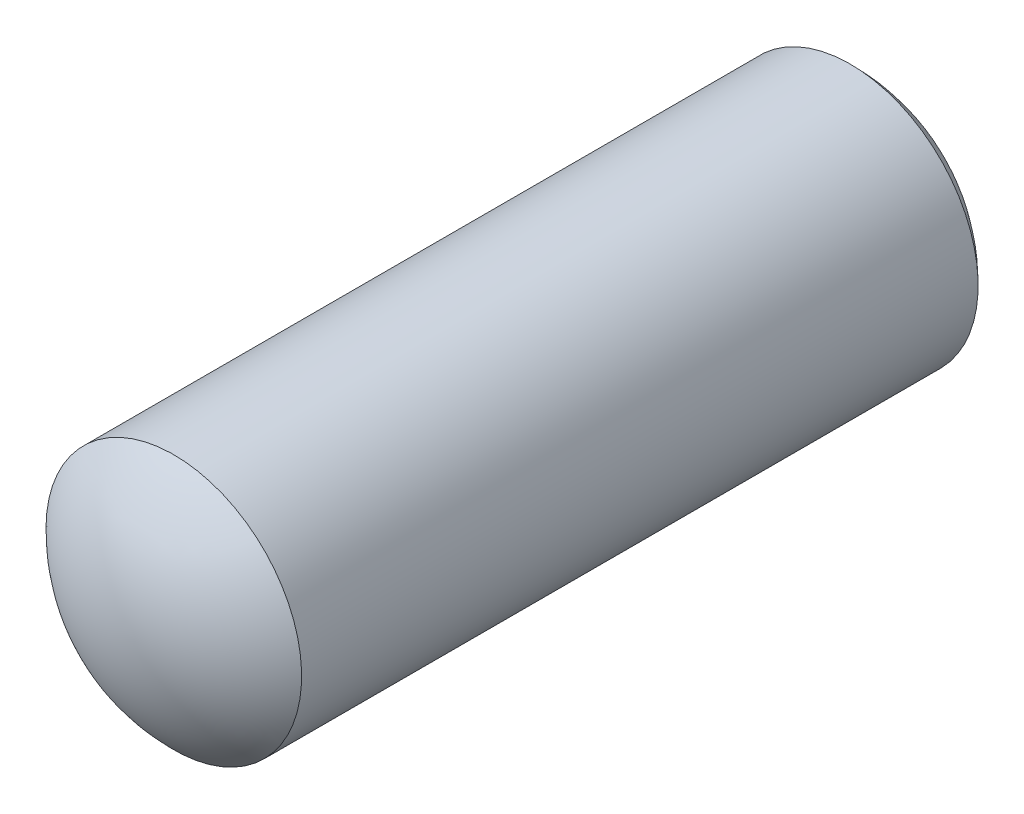
ISO-10303-21;
HEADER;
FILE_DESCRIPTION(('STEP AP214'),'2;1');
FILE_NAME('part.step','',(''),(''),'','','');
FILE_SCHEMA(('AUTOMOTIVE_DESIGN { 1 0 10303 214 1 1 1 1 }'));
ENDSEC;
DATA;
#1=APPLICATION_CONTEXT('core data for automotive mechanical design processes');
#2=APPLICATION_PROTOCOL_DEFINITION('international standard','automotive_design',2000,#1);
#3=PRODUCT_CONTEXT('',#1,'mechanical');
#4=PRODUCT('Part','Part','',(#3));
#5=PRODUCT_RELATED_PRODUCT_CATEGORY('part','',(#4));
#6=PRODUCT_DEFINITION_FORMATION('','',#4);
#7=PRODUCT_DEFINITION_CONTEXT('part definition',#1,'design');
#8=PRODUCT_DEFINITION('design','',#6,#7);
#9=PRODUCT_DEFINITION_SHAPE('','',#8);
#10=(LENGTH_UNIT() NAMED_UNIT(*) SI_UNIT(.MILLI.,.METRE.));
#11=(NAMED_UNIT(*) PLANE_ANGLE_UNIT() SI_UNIT($,.RADIAN.));
#12=(NAMED_UNIT(*) SI_UNIT($,.STERADIAN.) SOLID_ANGLE_UNIT());
#13=UNCERTAINTY_MEASURE_WITH_UNIT(LENGTH_MEASURE(1.E-05),#10,'distance_accuracy_value','');
#14=(GEOMETRIC_REPRESENTATION_CONTEXT(3) GLOBAL_UNCERTAINTY_ASSIGNED_CONTEXT((#13)) GLOBAL_UNIT_ASSIGNED_CONTEXT((#10,
#11,#12)) REPRESENTATION_CONTEXT('',''));
#15=CARTESIAN_POINT('',(0.,0.,0.));
#16=DIRECTION('',(0.,0.,1.));
#17=DIRECTION('',(1.,0.,0.));
#18=AXIS2_PLACEMENT_3D('',#15,#16,#17);
#19=CARTESIAN_POINT('',(6.89621486598266,5.97560419725074,7.875));
#20=DIRECTION('',(0.654860733945285,-0.755749574354258,0.));
#21=DIRECTION('',(0.,0.,1.));
#22=AXIS2_PLACEMENT_3D('',#19,#20,#21);
#23=SPHERICAL_SURFACE('',#22,1.575);
#24=CARTESIAN_POINT('',(6.89621486598266,5.97560419725074,7.875));
#25=DIRECTION('',(0.,0.,1.));
#26=DIRECTION('',(-0.755749574354258,-0.654860733945285,0.));
#27=AXIS2_PLACEMENT_3D('',#24,#25,#26);
#28=SPHERICAL_SURFACE('',#27,1.575);
#29=CARTESIAN_POINT('',(6.89621486598266,5.97560419725074,8.97727038425245));
#30=DIRECTION('',(0.,0.,1.));
#31=DIRECTION('',(-0.755749574354258,-0.654860733945285,0.));
#32=AXIS2_PLACEMENT_3D('',#29,#30,#31);
#33=CIRCLE('',#32,1.125);
#34=CARTESIAN_POINT('',(6.04599659483412,5.23888587156229,8.97727038425245));
#35=VERTEX_POINT('',#34);
#36=EDGE_CURVE('E11',#35,#35,#33,.T.);
#37=ORIENTED_EDGE('',*,*,#36,.T.);
#38=EDGE_LOOP('',(#37));
#39=FACE_BOUND('',#38,.T.);
#40=ADVANCED_FACE('F17',(#39),#28,.T.);
#41=CARTESIAN_POINT('',(6.89621486598266,5.97560419725074,6.));
#42=DIRECTION('',(0.,0.,1.));
#43=DIRECTION('',(-0.755749574354258,-0.654860733945285,0.));
#44=AXIS2_PLACEMENT_3D('',#41,#42,#43);
#45=CYLINDRICAL_SURFACE('',#44,1.125);
#46=CARTESIAN_POINT('',(6.89621486598266,5.97560419725074,3.02272961574759));
#47=DIRECTION('',(0.,0.,1.));
#48=DIRECTION('',(-0.755749574354258,-0.654860733945285,0.));
#49=AXIS2_PLACEMENT_3D('',#46,#47,#48);
#50=CIRCLE('',#49,1.125);
#51=CARTESIAN_POINT('',(6.04599659483412,5.23888587156229,3.02272961574759));
#52=VERTEX_POINT('',#51);
#53=EDGE_CURVE('E26',#52,#52,#50,.T.);
#54=ORIENTED_EDGE('',*,*,#53,.T.);
#55=EDGE_LOOP('',(#54));
#56=FACE_BOUND('',#55,.T.);
#57=ORIENTED_EDGE('',*,*,#36,.F.);
#58=EDGE_LOOP('',(#57));
#59=FACE_BOUND('',#58,.T.);
#60=ADVANCED_FACE('F19',(#56,#59),#45,.T.);
#61=CARTESIAN_POINT('',(6.89621486598266,5.97560419725074,4.125));
#62=DIRECTION('',(0.654860733945285,-0.755749574354258,0.));
#63=DIRECTION('',(0.,0.,-1.));
#64=AXIS2_PLACEMENT_3D('',#61,#62,#63);
#65=SPHERICAL_SURFACE('',#64,1.575);
#66=CARTESIAN_POINT('',(6.89621486598266,5.97560419725074,4.125));
#67=DIRECTION('',(0.,0.,1.));
#68=DIRECTION('',(-0.755749574354258,-0.654860733945285,0.));
#69=AXIS2_PLACEMENT_3D('',#66,#67,#68);
#70=SPHERICAL_SURFACE('',#69,1.575);
#71=ORIENTED_EDGE('',*,*,#53,.F.);
#72=EDGE_LOOP('',(#71));
#73=FACE_BOUND('',#72,.T.);
#74=ADVANCED_FACE('F48',(#73),#70,.T.);
#75=CLOSED_SHELL('',(#40,#60,#74));
#76=MANIFOLD_SOLID_BREP('B1',#75);
#77=ADVANCED_BREP_SHAPE_REPRESENTATION('',(#18,#76),#14);
#78=SHAPE_DEFINITION_REPRESENTATION(#9,#77);
ENDSEC;
END-ISO-10303-21;
